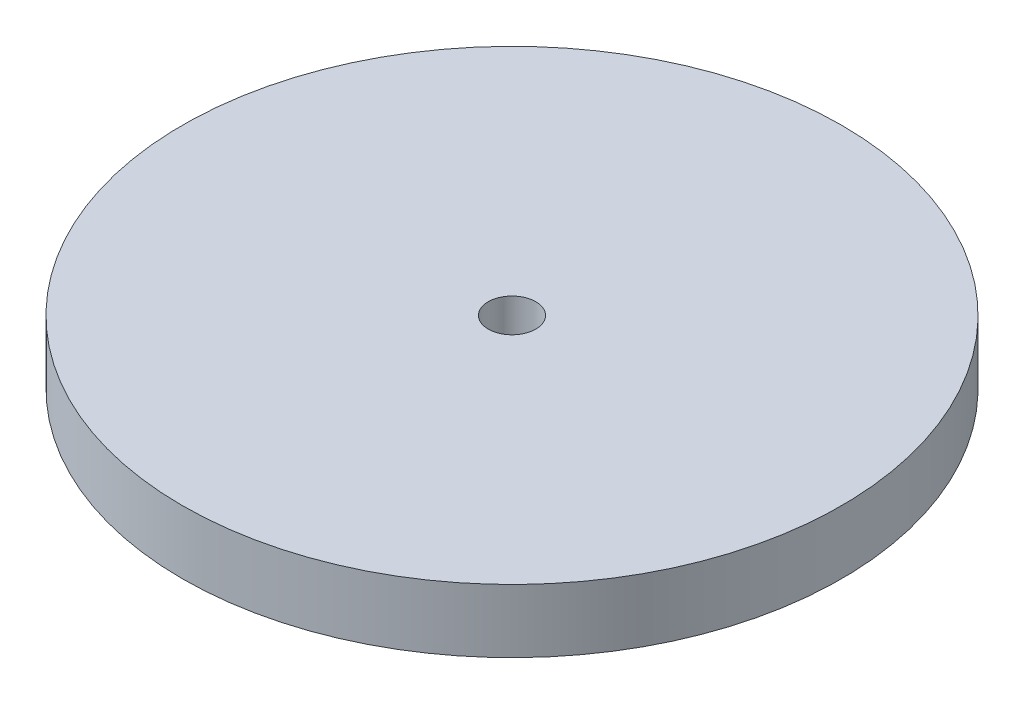
ISO-10303-21;
HEADER;
FILE_DESCRIPTION(('STEP AP214'),'2;1');
FILE_NAME('part.step','',(''),(''),'','','');
FILE_SCHEMA(('AUTOMOTIVE_DESIGN { 1 0 10303 214 1 1 1 1 }'));
ENDSEC;
DATA;
#1=APPLICATION_CONTEXT('core data for automotive mechanical design processes');
#2=APPLICATION_PROTOCOL_DEFINITION('international standard','automotive_design',2000,#1);
#3=PRODUCT_CONTEXT('',#1,'mechanical');
#4=PRODUCT('Part','Part','',(#3));
#5=PRODUCT_RELATED_PRODUCT_CATEGORY('part','',(#4));
#6=PRODUCT_DEFINITION_FORMATION('','',#4);
#7=PRODUCT_DEFINITION_CONTEXT('part definition',#1,'design');
#8=PRODUCT_DEFINITION('design','',#6,#7);
#9=PRODUCT_DEFINITION_SHAPE('','',#8);
#10=(LENGTH_UNIT() NAMED_UNIT(*) SI_UNIT(.MILLI.,.METRE.));
#11=(NAMED_UNIT(*) PLANE_ANGLE_UNIT() SI_UNIT($,.RADIAN.));
#12=(NAMED_UNIT(*) SI_UNIT($,.STERADIAN.) SOLID_ANGLE_UNIT());
#13=UNCERTAINTY_MEASURE_WITH_UNIT(LENGTH_MEASURE(1.E-05),#10,'distance_accuracy_value','');
#14=(GEOMETRIC_REPRESENTATION_CONTEXT(3) GLOBAL_UNCERTAINTY_ASSIGNED_CONTEXT((#13)) GLOBAL_UNIT_ASSIGNED_CONTEXT((#10,
#11,#12)) REPRESENTATION_CONTEXT('',''));
#15=CARTESIAN_POINT('',(0.,0.,0.));
#16=DIRECTION('',(0.,0.,1.));
#17=DIRECTION('',(1.,0.,0.));
#18=AXIS2_PLACEMENT_3D('',#15,#16,#17);
#19=CARTESIAN_POINT('',(0.,12.7,0.));
#20=DIRECTION('',(0.,-1.,0.));
#21=DIRECTION('',(0.,0.,-1.));
#22=AXIS2_PLACEMENT_3D('',#19,#20,#21);
#23=CYLINDRICAL_SURFACE('',#22,66.04);
#24=CARTESIAN_POINT('',(0.,12.7,0.));
#25=DIRECTION('',(0.,1.,0.));
#26=DIRECTION('',(0.,0.,1.));
#27=AXIS2_PLACEMENT_3D('',#24,#25,#26);
#28=CIRCLE('',#27,66.04);
#29=CARTESIAN_POINT('',(0.,12.7,66.04));
#30=VERTEX_POINT('',#29);
#31=EDGE_CURVE('E10',#30,#30,#28,.T.);
#32=ORIENTED_EDGE('',*,*,#31,.F.);
#33=EDGE_LOOP('',(#32));
#34=FACE_BOUND('',#33,.T.);
#35=CARTESIAN_POINT('',(0.,0.,0.));
#36=DIRECTION('',(0.,1.,0.));
#37=DIRECTION('',(0.,0.,1.));
#38=AXIS2_PLACEMENT_3D('',#35,#36,#37);
#39=CIRCLE('',#38,66.04);
#40=CARTESIAN_POINT('',(0.,0.,66.04));
#41=VERTEX_POINT('',#40);
#42=EDGE_CURVE('E34',#41,#41,#39,.T.);
#43=ORIENTED_EDGE('',*,*,#42,.T.);
#44=EDGE_LOOP('',(#43));
#45=FACE_BOUND('',#44,.T.);
#46=ADVANCED_FACE('F31',(#34,#45),#23,.T.);
#47=CARTESIAN_POINT('',(0.,12.7,0.));
#48=DIRECTION('',(0.,1.,0.));
#49=DIRECTION('',(0.,0.,1.));
#50=AXIS2_PLACEMENT_3D('',#47,#48,#49);
#51=PLANE('',#50);
#52=CARTESIAN_POINT('',(0.,12.7,0.));
#53=DIRECTION('',(0.,1.,0.));
#54=DIRECTION('',(0.,0.,1.));
#55=AXIS2_PLACEMENT_3D('',#52,#53,#54);
#56=CIRCLE('',#55,4.7625);
#57=CARTESIAN_POINT('',(0.,12.7,4.7625));
#58=VERTEX_POINT('',#57);
#59=EDGE_CURVE('E43',#58,#58,#56,.T.);
#60=ORIENTED_EDGE('',*,*,#59,.F.);
#61=EDGE_LOOP('',(#60));
#62=FACE_BOUND('',#61,.T.);
#63=ORIENTED_EDGE('',*,*,#31,.T.);
#64=EDGE_LOOP('',(#63));
#65=FACE_BOUND('',#64,.T.);
#66=ADVANCED_FACE('F58',(#62,#65),#51,.T.);
#67=CARTESIAN_POINT('',(0.,0.,0.));
#68=DIRECTION('',(0.,1.,0.));
#69=DIRECTION('',(0.,0.,1.));
#70=AXIS2_PLACEMENT_3D('',#67,#68,#69);
#71=PLANE('',#70);
#72=CARTESIAN_POINT('',(0.,0.,0.));
#73=DIRECTION('',(0.,1.,0.));
#74=DIRECTION('',(0.,0.,1.));
#75=AXIS2_PLACEMENT_3D('',#72,#73,#74);
#76=CIRCLE('',#75,4.7625);
#77=CARTESIAN_POINT('',(0.,0.,4.7625));
#78=VERTEX_POINT('',#77);
#79=EDGE_CURVE('E41',#78,#78,#76,.T.);
#80=ORIENTED_EDGE('',*,*,#79,.T.);
#81=EDGE_LOOP('',(#80));
#82=FACE_BOUND('',#81,.T.);
#83=ORIENTED_EDGE('',*,*,#42,.F.);
#84=EDGE_LOOP('',(#83));
#85=FACE_BOUND('',#84,.T.);
#86=ADVANCED_FACE('F49',(#82,#85),#71,.F.);
#87=CARTESIAN_POINT('',(0.,0.,0.));
#88=DIRECTION('',(0.,1.,0.));
#89=DIRECTION('',(0.,0.,1.));
#90=AXIS2_PLACEMENT_3D('',#87,#88,#89);
#91=CYLINDRICAL_SURFACE('',#90,4.7625);
#92=ORIENTED_EDGE('',*,*,#79,.F.);
#93=EDGE_LOOP('',(#92));
#94=FACE_BOUND('',#93,.T.);
#95=ORIENTED_EDGE('',*,*,#59,.T.);
#96=EDGE_LOOP('',(#95));
#97=FACE_BOUND('',#96,.T.);
#98=ADVANCED_FACE('F52',(#94,#97),#91,.F.);
#99=CLOSED_SHELL('',(#46,#66,#86,#98));
#100=MANIFOLD_SOLID_BREP('B2',#99);
#101=ADVANCED_BREP_SHAPE_REPRESENTATION('',(#18,#100),#14);
#102=SHAPE_DEFINITION_REPRESENTATION(#9,#101);
ENDSEC;
END-ISO-10303-21;
